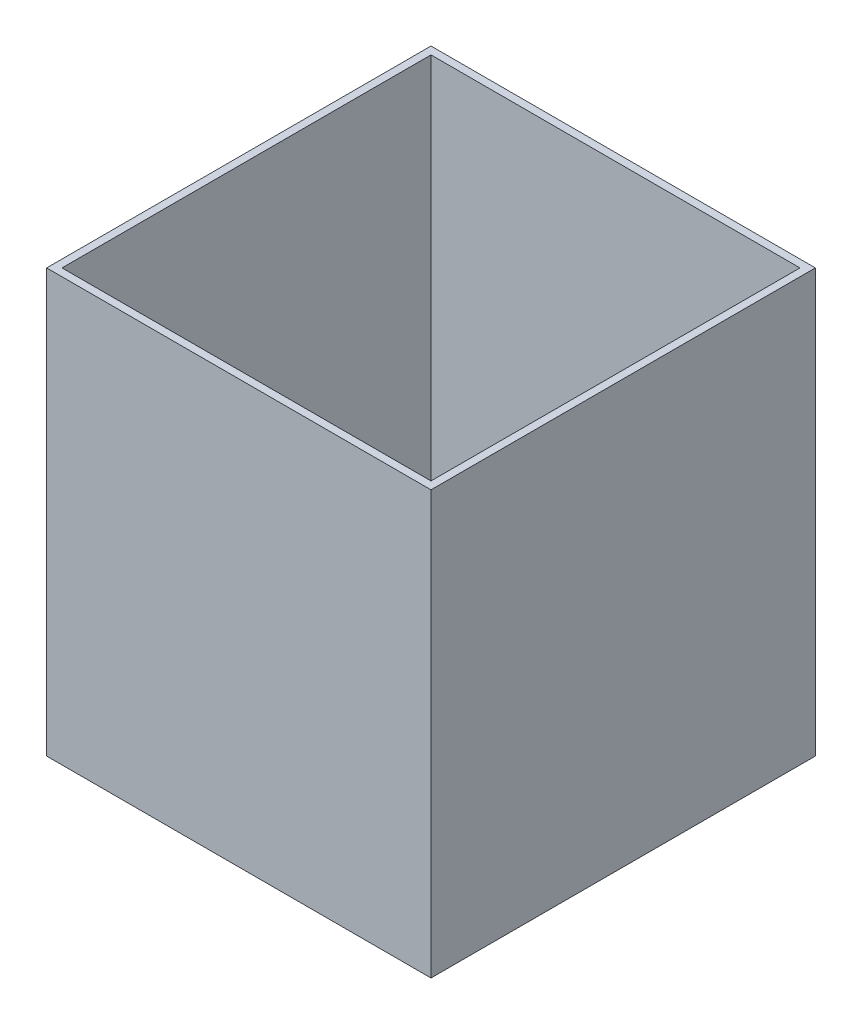
ISO-10303-21;
HEADER;
FILE_DESCRIPTION(('STEP AP214'),'2;1');
FILE_NAME('part.step','',(''),(''),'','','');
FILE_SCHEMA(('AUTOMOTIVE_DESIGN { 1 0 10303 214 1 1 1 1 }'));
ENDSEC;
DATA;
#1=APPLICATION_CONTEXT('core data for automotive mechanical design processes');
#2=APPLICATION_PROTOCOL_DEFINITION('international standard','automotive_design',2000,#1);
#3=PRODUCT_CONTEXT('',#1,'mechanical');
#4=PRODUCT('Part','Part','',(#3));
#5=PRODUCT_RELATED_PRODUCT_CATEGORY('part','',(#4));
#6=PRODUCT_DEFINITION_FORMATION('','',#4);
#7=PRODUCT_DEFINITION_CONTEXT('part definition',#1,'design');
#8=PRODUCT_DEFINITION('design','',#6,#7);
#9=PRODUCT_DEFINITION_SHAPE('','',#8);
#10=(LENGTH_UNIT() NAMED_UNIT(*) SI_UNIT(.MILLI.,.METRE.));
#11=(NAMED_UNIT(*) PLANE_ANGLE_UNIT() SI_UNIT($,.RADIAN.));
#12=(NAMED_UNIT(*) SI_UNIT($,.STERADIAN.) SOLID_ANGLE_UNIT());
#13=UNCERTAINTY_MEASURE_WITH_UNIT(LENGTH_MEASURE(1.E-05),#10,'distance_accuracy_value','');
#14=(GEOMETRIC_REPRESENTATION_CONTEXT(3) GLOBAL_UNCERTAINTY_ASSIGNED_CONTEXT((#13)) GLOBAL_UNIT_ASSIGNED_CONTEXT((#10,
#11,#12)) REPRESENTATION_CONTEXT('',''));
#15=CARTESIAN_POINT('',(0.,0.,0.));
#16=DIRECTION('',(0.,0.,1.));
#17=DIRECTION('',(1.,0.,0.));
#18=AXIS2_PLACEMENT_3D('',#15,#16,#17);
#19=CARTESIAN_POINT('',(10.,2.,10.));
#20=DIRECTION('',(-1.,0.,0.));
#21=DIRECTION('',(0.,0.,1.));
#22=AXIS2_PLACEMENT_3D('',#19,#20,#21);
#23=PLANE('',#22);
#24=DIRECTION('',(0.,0.,-1.));
#25=VECTOR('',#24,1.);
#26=CARTESIAN_POINT('',(10.,0.,10.));
#27=LINE('',#26,#25);
#28=CARTESIAN_POINT('',(10.,0.,10.));
#29=VERTEX_POINT('',#28);
#30=CARTESIAN_POINT('',(10.,0.,-10.));
#31=VERTEX_POINT('',#30);
#32=EDGE_CURVE('E176',#29,#31,#27,.T.);
#33=ORIENTED_EDGE('',*,*,#32,.T.);
#34=DIRECTION('',(0.,-1.,0.));
#35=VECTOR('',#34,1.);
#36=CARTESIAN_POINT('',(10.,2.,-10.));
#37=LINE('',#36,#35);
#38=CARTESIAN_POINT('',(10.,22.,-10.));
#39=VERTEX_POINT('',#38);
#40=EDGE_CURVE('E12',#39,#31,#37,.T.);
#41=ORIENTED_EDGE('',*,*,#40,.F.);
#42=DIRECTION('',(0.,0.,-1.));
#43=VECTOR('',#42,1.);
#44=CARTESIAN_POINT('',(10.,22.,10.));
#45=LINE('',#44,#43);
#46=CARTESIAN_POINT('',(10.,22.,10.));
#47=VERTEX_POINT('',#46);
#48=EDGE_CURVE('E167',#47,#39,#45,.T.);
#49=ORIENTED_EDGE('',*,*,#48,.F.);
#50=DIRECTION('',(0.,-1.,0.));
#51=VECTOR('',#50,1.);
#52=CARTESIAN_POINT('',(10.,2.,10.));
#53=LINE('',#52,#51);
#54=EDGE_CURVE('E184',#47,#29,#53,.T.);
#55=ORIENTED_EDGE('',*,*,#54,.T.);
#56=EDGE_LOOP('',(#33,#41,#49,#55));
#57=FACE_BOUND('',#56,.T.);
#58=ADVANCED_FACE('F59',(#57),#23,.F.);
#59=CARTESIAN_POINT('',(-10.,2.,-10.));
#60=DIRECTION('',(0.,0.,1.));
#61=DIRECTION('',(1.,0.,0.));
#62=AXIS2_PLACEMENT_3D('',#59,#60,#61);
#63=PLANE('',#62);
#64=DIRECTION('',(-1.,0.,0.));
#65=VECTOR('',#64,1.);
#66=CARTESIAN_POINT('',(-10.,0.,-10.));
#67=LINE('',#66,#65);
#68=CARTESIAN_POINT('',(-10.,0.,-10.));
#69=VERTEX_POINT('',#68);
#70=EDGE_CURVE('E179',#31,#69,#67,.T.);
#71=ORIENTED_EDGE('',*,*,#70,.T.);
#72=DIRECTION('',(0.,-1.,0.));
#73=VECTOR('',#72,1.);
#74=CARTESIAN_POINT('',(-10.,2.,-10.));
#75=LINE('',#74,#73);
#76=CARTESIAN_POINT('',(-10.,22.,-10.));
#77=VERTEX_POINT('',#76);
#78=EDGE_CURVE('E66',#77,#69,#75,.T.);
#79=ORIENTED_EDGE('',*,*,#78,.F.);
#80=DIRECTION('',(-1.,0.,0.));
#81=VECTOR('',#80,1.);
#82=CARTESIAN_POINT('',(10.,22.,-10.));
#83=LINE('',#82,#81);
#84=EDGE_CURVE('E170',#39,#77,#83,.T.);
#85=ORIENTED_EDGE('',*,*,#84,.F.);
#86=ORIENTED_EDGE('',*,*,#40,.T.);
#87=EDGE_LOOP('',(#71,#79,#85,#86));
#88=FACE_BOUND('',#87,.T.);
#89=ADVANCED_FACE('F202',(#88),#63,.F.);
#90=CARTESIAN_POINT('',(-10.,2.,10.));
#91=DIRECTION('',(1.,0.,0.));
#92=DIRECTION('',(0.,0.,-1.));
#93=AXIS2_PLACEMENT_3D('',#90,#91,#92);
#94=PLANE('',#93);
#95=DIRECTION('',(0.,0.,1.));
#96=VECTOR('',#95,1.);
#97=CARTESIAN_POINT('',(-10.,0.,10.));
#98=LINE('',#97,#96);
#99=CARTESIAN_POINT('',(-10.,0.,10.));
#100=VERTEX_POINT('',#99);
#101=EDGE_CURVE('E181',#69,#100,#98,.T.);
#102=ORIENTED_EDGE('',*,*,#101,.T.);
#103=DIRECTION('',(0.,-1.,0.));
#104=VECTOR('',#103,1.);
#105=CARTESIAN_POINT('',(-10.,2.,10.));
#106=LINE('',#105,#104);
#107=CARTESIAN_POINT('',(-10.,22.,10.));
#108=VERTEX_POINT('',#107);
#109=EDGE_CURVE('E186',#108,#100,#106,.T.);
#110=ORIENTED_EDGE('',*,*,#109,.F.);
#111=DIRECTION('',(0.,0.,1.));
#112=VECTOR('',#111,1.);
#113=CARTESIAN_POINT('',(-10.,22.,-10.));
#114=LINE('',#113,#112);
#115=EDGE_CURVE('E173',#77,#108,#114,.T.);
#116=ORIENTED_EDGE('',*,*,#115,.F.);
#117=ORIENTED_EDGE('',*,*,#78,.T.);
#118=EDGE_LOOP('',(#102,#110,#116,#117));
#119=FACE_BOUND('',#118,.T.);
#120=ADVANCED_FACE('F191',(#119),#94,.F.);
#121=CARTESIAN_POINT('',(-10.,2.,10.));
#122=DIRECTION('',(0.,0.,-1.));
#123=DIRECTION('',(-1.,0.,0.));
#124=AXIS2_PLACEMENT_3D('',#121,#122,#123);
#125=PLANE('',#124);
#126=DIRECTION('',(1.,0.,0.));
#127=VECTOR('',#126,1.);
#128=CARTESIAN_POINT('',(-10.,0.,10.));
#129=LINE('',#128,#127);
#130=EDGE_CURVE('E81',#100,#29,#129,.T.);
#131=ORIENTED_EDGE('',*,*,#130,.T.);
#132=ORIENTED_EDGE('',*,*,#54,.F.);
#133=DIRECTION('',(1.,0.,0.));
#134=VECTOR('',#133,1.);
#135=CARTESIAN_POINT('',(-10.,22.,10.));
#136=LINE('',#135,#134);
#137=EDGE_CURVE('E141',#108,#47,#136,.T.);
#138=ORIENTED_EDGE('',*,*,#137,.F.);
#139=ORIENTED_EDGE('',*,*,#109,.T.);
#140=EDGE_LOOP('',(#131,#132,#138,#139));
#141=FACE_BOUND('',#140,.T.);
#142=ADVANCED_FACE('F200',(#141),#125,.F.);
#143=CARTESIAN_POINT('',(0.,0.,0.));
#144=DIRECTION('',(0.,-1.,0.));
#145=DIRECTION('',(0.,0.,-1.));
#146=AXIS2_PLACEMENT_3D('',#143,#144,#145);
#147=PLANE('',#146);
#148=ORIENTED_EDGE('',*,*,#32,.F.);
#149=ORIENTED_EDGE('',*,*,#130,.F.);
#150=ORIENTED_EDGE('',*,*,#101,.F.);
#151=ORIENTED_EDGE('',*,*,#70,.F.);
#152=EDGE_LOOP('',(#148,#149,#150,#151));
#153=FACE_BOUND('',#152,.T.);
#154=ADVANCED_FACE('F196',(#153),#147,.T.);
#155=CARTESIAN_POINT('',(0.,22.,0.));
#156=DIRECTION('',(0.,1.,0.));
#157=DIRECTION('',(0.,0.,1.));
#158=AXIS2_PLACEMENT_3D('',#155,#156,#157);
#159=PLANE('',#158);
#160=ORIENTED_EDGE('',*,*,#137,.T.);
#161=ORIENTED_EDGE('',*,*,#48,.T.);
#162=ORIENTED_EDGE('',*,*,#84,.T.);
#163=ORIENTED_EDGE('',*,*,#115,.T.);
#164=EDGE_LOOP('',(#160,#161,#162,#163));
#165=FACE_BOUND('',#164,.T.);
#166=DIRECTION('',(0.,0.,-1.));
#167=VECTOR('',#166,1.);
#168=CARTESIAN_POINT('',(9.6,22.,10.));
#169=LINE('',#168,#167);
#170=CARTESIAN_POINT('',(9.6,22.,9.6));
#171=VERTEX_POINT('',#170);
#172=CARTESIAN_POINT('',(9.6,22.,-9.6));
#173=VERTEX_POINT('',#172);
#174=EDGE_CURVE('E133',#171,#173,#169,.T.);
#175=ORIENTED_EDGE('',*,*,#174,.F.);
#176=DIRECTION('',(1.,0.,0.));
#177=VECTOR('',#176,1.);
#178=CARTESIAN_POINT('',(-10.,22.,9.6));
#179=LINE('',#178,#177);
#180=CARTESIAN_POINT('',(-9.6,22.,9.6));
#181=VERTEX_POINT('',#180);
#182=EDGE_CURVE('E125',#181,#171,#179,.T.);
#183=ORIENTED_EDGE('',*,*,#182,.F.);
#184=DIRECTION('',(0.,0.,1.));
#185=VECTOR('',#184,1.);
#186=CARTESIAN_POINT('',(-9.6,22.,-10.));
#187=LINE('',#186,#185);
#188=CARTESIAN_POINT('',(-9.6,22.,-9.6));
#189=VERTEX_POINT('',#188);
#190=EDGE_CURVE('E149',#189,#181,#187,.T.);
#191=ORIENTED_EDGE('',*,*,#190,.F.);
#192=DIRECTION('',(-1.,0.,0.));
#193=VECTOR('',#192,1.);
#194=CARTESIAN_POINT('',(10.,22.,-9.6));
#195=LINE('',#194,#193);
#196=EDGE_CURVE('E147',#173,#189,#195,.T.);
#197=ORIENTED_EDGE('',*,*,#196,.F.);
#198=EDGE_LOOP('',(#175,#183,#191,#197));
#199=FACE_BOUND('',#198,.T.);
#200=ADVANCED_FACE('F145',(#165,#199),#159,.T.);
#201=CARTESIAN_POINT('',(-10.,22.,9.6));
#202=DIRECTION('',(0.,0.,-1.));
#203=DIRECTION('',(-1.,0.,0.));
#204=AXIS2_PLACEMENT_3D('',#201,#202,#203);
#205=PLANE('',#204);
#206=DIRECTION('',(1.,0.,0.));
#207=VECTOR('',#206,1.);
#208=CARTESIAN_POINT('',(-10.,2.,9.6));
#209=LINE('',#208,#207);
#210=CARTESIAN_POINT('',(-9.6,2.,9.6));
#211=VERTEX_POINT('',#210);
#212=CARTESIAN_POINT('',(9.6,2.,9.6));
#213=VERTEX_POINT('',#212);
#214=EDGE_CURVE('E153',#211,#213,#209,.T.);
#215=ORIENTED_EDGE('',*,*,#214,.F.);
#216=DIRECTION('',(0.,-1.,0.));
#217=VECTOR('',#216,1.);
#218=CARTESIAN_POINT('',(-9.6,22.,9.6));
#219=LINE('',#218,#217);
#220=EDGE_CURVE('E73',#181,#211,#219,.T.);
#221=ORIENTED_EDGE('',*,*,#220,.F.);
#222=ORIENTED_EDGE('',*,*,#182,.T.);
#223=DIRECTION('',(0.,-1.,0.));
#224=VECTOR('',#223,1.);
#225=CARTESIAN_POINT('',(9.6,22.,9.6));
#226=LINE('',#225,#224);
#227=EDGE_CURVE('E128',#171,#213,#226,.T.);
#228=ORIENTED_EDGE('',*,*,#227,.T.);
#229=EDGE_LOOP('',(#215,#221,#222,#228));
#230=FACE_BOUND('',#229,.T.);
#231=ADVANCED_FACE('F127',(#230),#205,.T.);
#232=CARTESIAN_POINT('',(9.6,22.,10.));
#233=DIRECTION('',(-1.,0.,0.));
#234=DIRECTION('',(0.,0.,1.));
#235=AXIS2_PLACEMENT_3D('',#232,#233,#234);
#236=PLANE('',#235);
#237=DIRECTION('',(0.,0.,-1.));
#238=VECTOR('',#237,1.);
#239=CARTESIAN_POINT('',(9.6,2.,10.));
#240=LINE('',#239,#238);
#241=CARTESIAN_POINT('',(9.6,2.,-9.6));
#242=VERTEX_POINT('',#241);
#243=EDGE_CURVE('E140',#213,#242,#240,.T.);
#244=ORIENTED_EDGE('',*,*,#243,.F.);
#245=ORIENTED_EDGE('',*,*,#227,.F.);
#246=ORIENTED_EDGE('',*,*,#174,.T.);
#247=DIRECTION('',(0.,-1.,0.));
#248=VECTOR('',#247,1.);
#249=CARTESIAN_POINT('',(9.6,22.,-9.6));
#250=LINE('',#249,#248);
#251=EDGE_CURVE('E142',#173,#242,#250,.T.);
#252=ORIENTED_EDGE('',*,*,#251,.T.);
#253=EDGE_LOOP('',(#244,#245,#246,#252));
#254=FACE_BOUND('',#253,.T.);
#255=ADVANCED_FACE('F137',(#254),#236,.T.);
#256=CARTESIAN_POINT('',(10.,22.,-9.6));
#257=DIRECTION('',(0.,0.,1.));
#258=DIRECTION('',(1.,0.,0.));
#259=AXIS2_PLACEMENT_3D('',#256,#257,#258);
#260=PLANE('',#259);
#261=DIRECTION('',(-1.,0.,0.));
#262=VECTOR('',#261,1.);
#263=CARTESIAN_POINT('',(10.,2.,-9.6));
#264=LINE('',#263,#262);
#265=CARTESIAN_POINT('',(-9.6,2.,-9.6));
#266=VERTEX_POINT('',#265);
#267=EDGE_CURVE('E156',#242,#266,#264,.T.);
#268=ORIENTED_EDGE('',*,*,#267,.F.);
#269=ORIENTED_EDGE('',*,*,#251,.F.);
#270=ORIENTED_EDGE('',*,*,#196,.T.);
#271=DIRECTION('',(0.,-1.,0.));
#272=VECTOR('',#271,1.);
#273=CARTESIAN_POINT('',(-9.6,22.,-9.6));
#274=LINE('',#273,#272);
#275=EDGE_CURVE('E162',#189,#266,#274,.T.);
#276=ORIENTED_EDGE('',*,*,#275,.T.);
#277=EDGE_LOOP('',(#268,#269,#270,#276));
#278=FACE_BOUND('',#277,.T.);
#279=ADVANCED_FACE('F225',(#278),#260,.T.);
#280=CARTESIAN_POINT('',(-9.6,22.,-10.));
#281=DIRECTION('',(1.,0.,0.));
#282=DIRECTION('',(0.,0.,-1.));
#283=AXIS2_PLACEMENT_3D('',#280,#281,#282);
#284=PLANE('',#283);
#285=DIRECTION('',(0.,0.,1.));
#286=VECTOR('',#285,1.);
#287=CARTESIAN_POINT('',(-9.6,2.,-10.));
#288=LINE('',#287,#286);
#289=EDGE_CURVE('E134',#266,#211,#288,.T.);
#290=ORIENTED_EDGE('',*,*,#289,.F.);
#291=ORIENTED_EDGE('',*,*,#275,.F.);
#292=ORIENTED_EDGE('',*,*,#190,.T.);
#293=ORIENTED_EDGE('',*,*,#220,.T.);
#294=EDGE_LOOP('',(#290,#291,#292,#293));
#295=FACE_BOUND('',#294,.T.);
#296=ADVANCED_FACE('F217',(#295),#284,.T.);
#297=CARTESIAN_POINT('',(0.,2.,0.));
#298=DIRECTION('',(0.,-1.,0.));
#299=DIRECTION('',(0.,0.,-1.));
#300=AXIS2_PLACEMENT_3D('',#297,#298,#299);
#301=PLANE('',#300);
#302=ORIENTED_EDGE('',*,*,#289,.T.);
#303=ORIENTED_EDGE('',*,*,#214,.T.);
#304=ORIENTED_EDGE('',*,*,#243,.T.);
#305=ORIENTED_EDGE('',*,*,#267,.T.);
#306=EDGE_LOOP('',(#302,#303,#304,#305));
#307=FACE_BOUND('',#306,.T.);
#308=ADVANCED_FACE('F214',(#307),#301,.F.);
#309=CLOSED_SHELL('',(#58,#89,#120,#142,#154,#200,#231,#255,#279,#296,#308));
#310=MANIFOLD_SOLID_BREP('B2',#309);
#311=ADVANCED_BREP_SHAPE_REPRESENTATION('',(#18,#310),#14);
#312=SHAPE_DEFINITION_REPRESENTATION(#9,#311);
ENDSEC;
END-ISO-10303-21;
